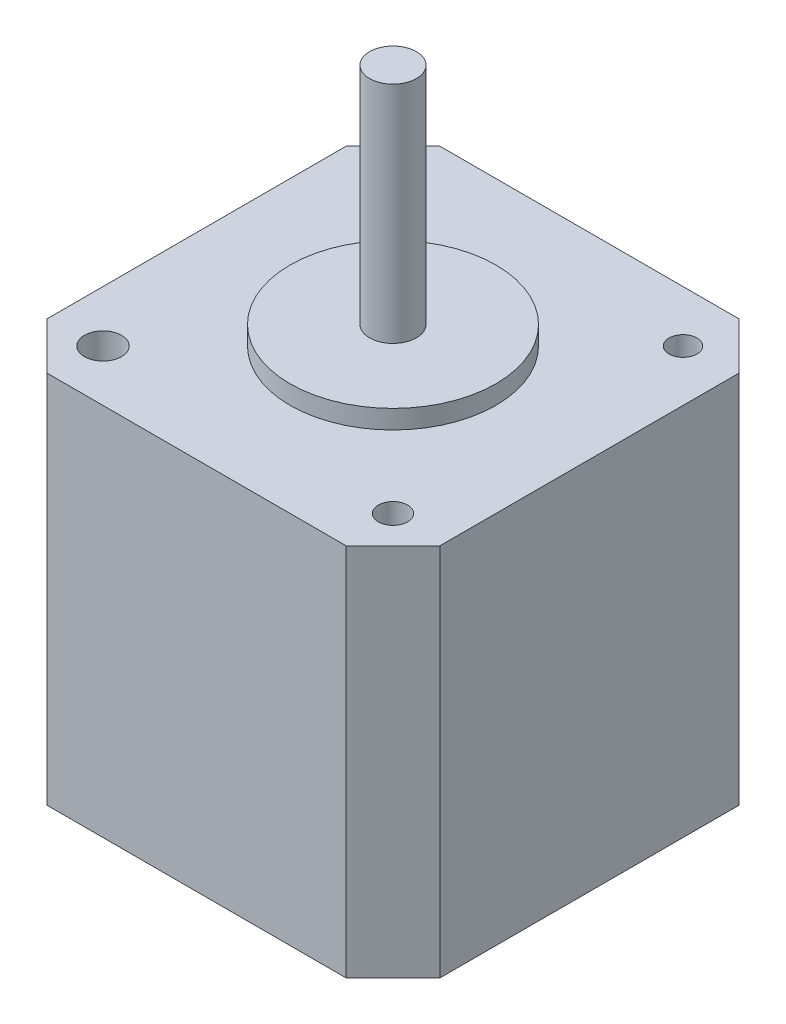
ISO-10303-21;
HEADER;
FILE_DESCRIPTION(('STEP AP214'),'2;1');
FILE_NAME('part.step','',(''),(''),'','','');
FILE_SCHEMA(('AUTOMOTIVE_DESIGN { 1 0 10303 214 1 1 1 1 }'));
ENDSEC;
DATA;
#1=APPLICATION_CONTEXT('core data for automotive mechanical design processes');
#2=APPLICATION_PROTOCOL_DEFINITION('international standard','automotive_design',2000,#1);
#3=PRODUCT_CONTEXT('',#1,'mechanical');
#4=PRODUCT('Part','Part','',(#3));
#5=PRODUCT_RELATED_PRODUCT_CATEGORY('part','',(#4));
#6=PRODUCT_DEFINITION_FORMATION('','',#4);
#7=PRODUCT_DEFINITION_CONTEXT('part definition',#1,'design');
#8=PRODUCT_DEFINITION('design','',#6,#7);
#9=PRODUCT_DEFINITION_SHAPE('','',#8);
#10=(LENGTH_UNIT() NAMED_UNIT(*) SI_UNIT(.MILLI.,.METRE.));
#11=(NAMED_UNIT(*) PLANE_ANGLE_UNIT() SI_UNIT($,.RADIAN.));
#12=(NAMED_UNIT(*) SI_UNIT($,.STERADIAN.) SOLID_ANGLE_UNIT());
#13=UNCERTAINTY_MEASURE_WITH_UNIT(LENGTH_MEASURE(1.E-05),#10,'distance_accuracy_value','');
#14=(GEOMETRIC_REPRESENTATION_CONTEXT(3) GLOBAL_UNCERTAINTY_ASSIGNED_CONTEXT((#13)) GLOBAL_UNIT_ASSIGNED_CONTEXT((#10,
#11,#12)) REPRESENTATION_CONTEXT('',''));
#15=CARTESIAN_POINT('',(0.,0.,0.));
#16=DIRECTION('',(0.,0.,1.));
#17=DIRECTION('',(1.,0.,0.));
#18=AXIS2_PLACEMENT_3D('',#15,#16,#17);
#19=CARTESIAN_POINT('',(-21.,40.,21.));
#20=DIRECTION('',(1.,0.,0.));
#21=DIRECTION('',(0.,0.,-1.));
#22=AXIS2_PLACEMENT_3D('',#19,#20,#21);
#23=PLANE('',#22);
#24=DIRECTION('',(0.,0.,1.));
#25=VECTOR('',#24,1.);
#26=CARTESIAN_POINT('',(-21.,0.,21.));
#27=LINE('',#26,#25);
#28=CARTESIAN_POINT('',(-21.,0.,-16.));
#29=VERTEX_POINT('',#28);
#30=CARTESIAN_POINT('',(-21.,0.,16.));
#31=VERTEX_POINT('',#30);
#32=EDGE_CURVE('E143',#29,#31,#27,.T.);
#33=ORIENTED_EDGE('',*,*,#32,.T.);
#34=DIRECTION('',(0.,1.,0.));
#35=VECTOR('',#34,1.);
#36=CARTESIAN_POINT('',(-21.,40.,16.));
#37=LINE('',#36,#35);
#38=CARTESIAN_POINT('',(-21.,40.,16.));
#39=VERTEX_POINT('',#38);
#40=EDGE_CURVE('E117',#31,#39,#37,.T.);
#41=ORIENTED_EDGE('',*,*,#40,.T.);
#42=DIRECTION('',(0.,0.,1.));
#43=VECTOR('',#42,1.);
#44=CARTESIAN_POINT('',(-21.,40.,21.));
#45=LINE('',#44,#43);
#46=CARTESIAN_POINT('',(-21.,40.,-16.));
#47=VERTEX_POINT('',#46);
#48=EDGE_CURVE('E156',#47,#39,#45,.T.);
#49=ORIENTED_EDGE('',*,*,#48,.F.);
#50=DIRECTION('',(0.,-1.,0.));
#51=VECTOR('',#50,1.);
#52=CARTESIAN_POINT('',(-21.,40.,-16.));
#53=LINE('',#52,#51);
#54=EDGE_CURVE('E123',#47,#29,#53,.T.);
#55=ORIENTED_EDGE('',*,*,#54,.T.);
#56=EDGE_LOOP('',(#33,#41,#49,#55));
#57=FACE_BOUND('',#56,.T.);
#58=ADVANCED_FACE('F41',(#57),#23,.F.);
#59=CARTESIAN_POINT('',(21.,40.,21.));
#60=DIRECTION('',(0.,0.,-1.));
#61=DIRECTION('',(-1.,0.,0.));
#62=AXIS2_PLACEMENT_3D('',#59,#60,#61);
#63=PLANE('',#62);
#64=DIRECTION('',(1.,0.,0.));
#65=VECTOR('',#64,1.);
#66=CARTESIAN_POINT('',(21.,40.,21.));
#67=LINE('',#66,#65);
#68=CARTESIAN_POINT('',(-16.,40.,21.));
#69=VERTEX_POINT('',#68);
#70=CARTESIAN_POINT('',(16.,40.,21.));
#71=VERTEX_POINT('',#70);
#72=EDGE_CURVE('E133',#69,#71,#67,.T.);
#73=ORIENTED_EDGE('',*,*,#72,.F.);
#74=DIRECTION('',(0.,-1.,0.));
#75=VECTOR('',#74,1.);
#76=CARTESIAN_POINT('',(-16.,40.,21.));
#77=LINE('',#76,#75);
#78=CARTESIAN_POINT('',(-16.,0.,21.));
#79=VERTEX_POINT('',#78);
#80=EDGE_CURVE('E116',#69,#79,#77,.T.);
#81=ORIENTED_EDGE('',*,*,#80,.T.);
#82=DIRECTION('',(1.,0.,0.));
#83=VECTOR('',#82,1.);
#84=CARTESIAN_POINT('',(21.,0.,21.));
#85=LINE('',#84,#83);
#86=CARTESIAN_POINT('',(16.,0.,21.));
#87=VERTEX_POINT('',#86);
#88=EDGE_CURVE('E130',#79,#87,#85,.T.);
#89=ORIENTED_EDGE('',*,*,#88,.T.);
#90=DIRECTION('',(0.,1.,0.));
#91=VECTOR('',#90,1.);
#92=CARTESIAN_POINT('',(16.,40.,21.));
#93=LINE('',#92,#91);
#94=EDGE_CURVE('E136',#87,#71,#93,.T.);
#95=ORIENTED_EDGE('',*,*,#94,.T.);
#96=EDGE_LOOP('',(#73,#81,#89,#95));
#97=FACE_BOUND('',#96,.T.);
#98=ADVANCED_FACE('F129',(#97),#63,.F.);
#99=CARTESIAN_POINT('',(21.,40.,21.));
#100=DIRECTION('',(-1.,0.,0.));
#101=DIRECTION('',(0.,0.,1.));
#102=AXIS2_PLACEMENT_3D('',#99,#100,#101);
#103=PLANE('',#102);
#104=DIRECTION('',(0.,0.,-1.));
#105=VECTOR('',#104,1.);
#106=CARTESIAN_POINT('',(21.,40.,21.));
#107=LINE('',#106,#105);
#108=CARTESIAN_POINT('',(21.,40.,16.));
#109=VERTEX_POINT('',#108);
#110=CARTESIAN_POINT('',(21.,40.,-16.));
#111=VERTEX_POINT('',#110);
#112=EDGE_CURVE('E208',#109,#111,#107,.T.);
#113=ORIENTED_EDGE('',*,*,#112,.F.);
#114=DIRECTION('',(0.,-1.,0.));
#115=VECTOR('',#114,1.);
#116=CARTESIAN_POINT('',(21.,40.,16.));
#117=LINE('',#116,#115);
#118=CARTESIAN_POINT('',(21.,0.,16.));
#119=VERTEX_POINT('',#118);
#120=EDGE_CURVE('E46',#109,#119,#117,.T.);
#121=ORIENTED_EDGE('',*,*,#120,.T.);
#122=DIRECTION('',(0.,0.,-1.));
#123=VECTOR('',#122,1.);
#124=CARTESIAN_POINT('',(21.,0.,21.));
#125=LINE('',#124,#123);
#126=CARTESIAN_POINT('',(21.,0.,-16.));
#127=VERTEX_POINT('',#126);
#128=EDGE_CURVE('E142',#119,#127,#125,.T.);
#129=ORIENTED_EDGE('',*,*,#128,.T.);
#130=DIRECTION('',(0.,1.,0.));
#131=VECTOR('',#130,1.);
#132=CARTESIAN_POINT('',(21.,40.,-16.));
#133=LINE('',#132,#131);
#134=EDGE_CURVE('E187',#127,#111,#133,.T.);
#135=ORIENTED_EDGE('',*,*,#134,.T.);
#136=EDGE_LOOP('',(#113,#121,#129,#135));
#137=FACE_BOUND('',#136,.T.);
#138=ADVANCED_FACE('F222',(#137),#103,.F.);
#139=CARTESIAN_POINT('',(21.,40.,-21.));
#140=DIRECTION('',(0.,0.,1.));
#141=DIRECTION('',(1.,0.,0.));
#142=AXIS2_PLACEMENT_3D('',#139,#140,#141);
#143=PLANE('',#142);
#144=DIRECTION('',(-1.,0.,0.));
#145=VECTOR('',#144,1.);
#146=CARTESIAN_POINT('',(21.,0.,-21.));
#147=LINE('',#146,#145);
#148=CARTESIAN_POINT('',(16.,0.,-21.));
#149=VERTEX_POINT('',#148);
#150=CARTESIAN_POINT('',(-16.,0.,-21.));
#151=VERTEX_POINT('',#150);
#152=EDGE_CURVE('E148',#149,#151,#147,.T.);
#153=ORIENTED_EDGE('',*,*,#152,.T.);
#154=DIRECTION('',(0.,1.,0.));
#155=VECTOR('',#154,1.);
#156=CARTESIAN_POINT('',(-16.,40.,-21.));
#157=LINE('',#156,#155);
#158=CARTESIAN_POINT('',(-16.,40.,-21.));
#159=VERTEX_POINT('',#158);
#160=EDGE_CURVE('E60',#151,#159,#157,.T.);
#161=ORIENTED_EDGE('',*,*,#160,.T.);
#162=DIRECTION('',(-1.,0.,0.));
#163=VECTOR('',#162,1.);
#164=CARTESIAN_POINT('',(21.,40.,-21.));
#165=LINE('',#164,#163);
#166=CARTESIAN_POINT('',(16.,40.,-21.));
#167=VERTEX_POINT('',#166);
#168=EDGE_CURVE('E158',#167,#159,#165,.T.);
#169=ORIENTED_EDGE('',*,*,#168,.F.);
#170=DIRECTION('',(0.,-1.,0.));
#171=VECTOR('',#170,1.);
#172=CARTESIAN_POINT('',(16.,40.,-21.));
#173=LINE('',#172,#171);
#174=EDGE_CURVE('E182',#167,#149,#173,.T.);
#175=ORIENTED_EDGE('',*,*,#174,.T.);
#176=EDGE_LOOP('',(#153,#161,#169,#175));
#177=FACE_BOUND('',#176,.T.);
#178=ADVANCED_FACE('F220',(#177),#143,.F.);
#179=CARTESIAN_POINT('',(0.,40.,0.));
#180=DIRECTION('',(0.,1.,0.));
#181=DIRECTION('',(0.,0.,1.));
#182=AXIS2_PLACEMENT_3D('',#179,#180,#181);
#183=PLANE('',#182);
#184=CARTESIAN_POINT('',(-15.5,40.,-15.5));
#185=DIRECTION('',(0.,1.,0.));
#186=DIRECTION('',(0.,0.,1.));
#187=AXIS2_PLACEMENT_3D('',#184,#185,#186);
#188=CIRCLE('',#187,1.58283387293328);
#189=CARTESIAN_POINT('',(-15.5,40.,-13.9171661270667));
#190=VERTEX_POINT('',#189);
#191=EDGE_CURVE('E417',#190,#190,#188,.T.);
#192=ORIENTED_EDGE('',*,*,#191,.F.);
#193=EDGE_LOOP('',(#192));
#194=FACE_BOUND('',#193,.T.);
#195=CARTESIAN_POINT('',(-15.5,40.,15.5));
#196=DIRECTION('',(0.,1.,0.));
#197=DIRECTION('',(0.,0.,1.));
#198=AXIS2_PLACEMENT_3D('',#195,#196,#197);
#199=CIRCLE('',#198,1.9811298432568);
#200=CARTESIAN_POINT('',(-15.5,40.,17.4811298432568));
#201=VERTEX_POINT('',#200);
#202=EDGE_CURVE('E437',#201,#201,#199,.T.);
#203=ORIENTED_EDGE('',*,*,#202,.F.);
#204=EDGE_LOOP('',(#203));
#205=FACE_BOUND('',#204,.T.);
#206=CARTESIAN_POINT('',(15.5,40.,15.5));
#207=DIRECTION('',(0.,1.,0.));
#208=DIRECTION('',(0.,0.,1.));
#209=AXIS2_PLACEMENT_3D('',#206,#207,#208);
#210=CIRCLE('',#209,1.56185503032757);
#211=CARTESIAN_POINT('',(15.5,40.,17.0618550303276));
#212=VERTEX_POINT('',#211);
#213=EDGE_CURVE('E429',#212,#212,#210,.T.);
#214=ORIENTED_EDGE('',*,*,#213,.F.);
#215=EDGE_LOOP('',(#214));
#216=FACE_BOUND('',#215,.T.);
#217=CARTESIAN_POINT('',(15.5,40.,-15.5));
#218=DIRECTION('',(0.,1.,0.));
#219=DIRECTION('',(0.,0.,1.));
#220=AXIS2_PLACEMENT_3D('',#217,#218,#219);
#221=CIRCLE('',#220,1.49004264650584);
#222=CARTESIAN_POINT('',(15.5,40.,-14.0099573534942));
#223=VERTEX_POINT('',#222);
#224=EDGE_CURVE('E428',#223,#223,#221,.T.);
#225=ORIENTED_EDGE('',*,*,#224,.F.);
#226=EDGE_LOOP('',(#225));
#227=FACE_BOUND('',#226,.T.);
#228=CARTESIAN_POINT('',(0.,40.,0.));
#229=DIRECTION('',(0.,1.,0.));
#230=DIRECTION('',(0.,0.,1.));
#231=AXIS2_PLACEMENT_3D('',#228,#229,#230);
#232=CIRCLE('',#231,11.);
#233=CARTESIAN_POINT('',(0.,40.,11.));
#234=VERTEX_POINT('',#233);
#235=EDGE_CURVE('E52',#234,#234,#232,.T.);
#236=ORIENTED_EDGE('',*,*,#235,.F.);
#237=EDGE_LOOP('',(#236));
#238=FACE_BOUND('',#237,.T.);
#239=ORIENTED_EDGE('',*,*,#48,.T.);
#240=DIRECTION('',(-0.707106781186547,0.,-0.707106781186549));
#241=VECTOR('',#240,1.);
#242=CARTESIAN_POINT('',(-18.5,40.,18.5));
#243=LINE('',#242,#241);
#244=EDGE_CURVE('E179',#39,#69,#243,.F.);
#245=ORIENTED_EDGE('',*,*,#244,.T.);
#246=ORIENTED_EDGE('',*,*,#72,.T.);
#247=DIRECTION('',(-0.707106781186549,0.,0.707106781186547));
#248=VECTOR('',#247,1.);
#249=CARTESIAN_POINT('',(18.5,40.,18.5));
#250=LINE('',#249,#248);
#251=EDGE_CURVE('E173',#71,#109,#250,.F.);
#252=ORIENTED_EDGE('',*,*,#251,.T.);
#253=ORIENTED_EDGE('',*,*,#112,.T.);
#254=DIRECTION('',(0.707106781186547,0.,0.707106781186549));
#255=VECTOR('',#254,1.);
#256=CARTESIAN_POINT('',(18.5,40.,-18.5));
#257=LINE('',#256,#255);
#258=EDGE_CURVE('E67',#111,#167,#257,.F.);
#259=ORIENTED_EDGE('',*,*,#258,.T.);
#260=ORIENTED_EDGE('',*,*,#168,.T.);
#261=DIRECTION('',(0.707106781186549,0.,-0.707106781186547));
#262=VECTOR('',#261,1.);
#263=CARTESIAN_POINT('',(-18.5,40.,-18.5));
#264=LINE('',#263,#262);
#265=EDGE_CURVE('E176',#159,#47,#264,.F.);
#266=ORIENTED_EDGE('',*,*,#265,.T.);
#267=EDGE_LOOP('',(#239,#245,#246,#252,#253,#259,#260,#266));
#268=FACE_BOUND('',#267,.T.);
#269=ADVANCED_FACE('F212',(#194,#205,#216,#227,#238,#268),#183,.T.);
#270=CARTESIAN_POINT('',(0.,0.,0.));
#271=DIRECTION('',(0.,1.,0.));
#272=DIRECTION('',(0.,0.,1.));
#273=AXIS2_PLACEMENT_3D('',#270,#271,#272);
#274=PLANE('',#273);
#275=ORIENTED_EDGE('',*,*,#88,.F.);
#276=DIRECTION('',(0.707106781186547,0.,0.707106781186549));
#277=VECTOR('',#276,1.);
#278=CARTESIAN_POINT('',(-16.,0.,21.));
#279=LINE('',#278,#277);
#280=EDGE_CURVE('E112',#79,#31,#279,.F.);
#281=ORIENTED_EDGE('',*,*,#280,.T.);
#282=ORIENTED_EDGE('',*,*,#32,.F.);
#283=DIRECTION('',(-0.707106781186549,0.,0.707106781186547));
#284=VECTOR('',#283,1.);
#285=CARTESIAN_POINT('',(-21.,0.,-16.));
#286=LINE('',#285,#284);
#287=EDGE_CURVE('E124',#29,#151,#286,.F.);
#288=ORIENTED_EDGE('',*,*,#287,.T.);
#289=ORIENTED_EDGE('',*,*,#152,.F.);
#290=DIRECTION('',(-0.707106781186547,0.,-0.707106781186549));
#291=VECTOR('',#290,1.);
#292=CARTESIAN_POINT('',(16.,0.,-21.));
#293=LINE('',#292,#291);
#294=EDGE_CURVE('E135',#149,#127,#293,.F.);
#295=ORIENTED_EDGE('',*,*,#294,.T.);
#296=ORIENTED_EDGE('',*,*,#128,.F.);
#297=DIRECTION('',(0.707106781186549,0.,-0.707106781186547));
#298=VECTOR('',#297,1.);
#299=CARTESIAN_POINT('',(21.,0.,16.));
#300=LINE('',#299,#298);
#301=EDGE_CURVE('E140',#119,#87,#300,.F.);
#302=ORIENTED_EDGE('',*,*,#301,.T.);
#303=EDGE_LOOP('',(#275,#281,#282,#288,#289,#295,#296,#302));
#304=FACE_BOUND('',#303,.T.);
#305=ADVANCED_FACE('F138',(#304),#274,.F.);
#306=CARTESIAN_POINT('',(-16.,40.,21.));
#307=DIRECTION('',(0.707106781186549,0.,-0.707106781186547));
#308=DIRECTION('',(0.,-1.,0.));
#309=AXIS2_PLACEMENT_3D('',#306,#307,#308);
#310=PLANE('',#309);
#311=ORIENTED_EDGE('',*,*,#244,.F.);
#312=ORIENTED_EDGE('',*,*,#40,.F.);
#313=ORIENTED_EDGE('',*,*,#280,.F.);
#314=ORIENTED_EDGE('',*,*,#80,.F.);
#315=EDGE_LOOP('',(#311,#312,#313,#314));
#316=FACE_BOUND('',#315,.T.);
#317=ADVANCED_FACE('F115',(#316),#310,.F.);
#318=CARTESIAN_POINT('',(-21.,40.,-16.));
#319=DIRECTION('',(0.707106781186547,0.,0.707106781186549));
#320=DIRECTION('',(0.,-1.,0.));
#321=AXIS2_PLACEMENT_3D('',#318,#319,#320);
#322=PLANE('',#321);
#323=ORIENTED_EDGE('',*,*,#265,.F.);
#324=ORIENTED_EDGE('',*,*,#160,.F.);
#325=ORIENTED_EDGE('',*,*,#287,.F.);
#326=ORIENTED_EDGE('',*,*,#54,.F.);
#327=EDGE_LOOP('',(#323,#324,#325,#326));
#328=FACE_BOUND('',#327,.T.);
#329=ADVANCED_FACE('F217',(#328),#322,.F.);
#330=CARTESIAN_POINT('',(21.,40.,16.));
#331=DIRECTION('',(-0.707106781186547,0.,-0.707106781186549));
#332=DIRECTION('',(0.,-1.,0.));
#333=AXIS2_PLACEMENT_3D('',#330,#331,#332);
#334=PLANE('',#333);
#335=ORIENTED_EDGE('',*,*,#251,.F.);
#336=ORIENTED_EDGE('',*,*,#94,.F.);
#337=ORIENTED_EDGE('',*,*,#301,.F.);
#338=ORIENTED_EDGE('',*,*,#120,.F.);
#339=EDGE_LOOP('',(#335,#336,#337,#338));
#340=FACE_BOUND('',#339,.T.);
#341=ADVANCED_FACE('F246',(#340),#334,.F.);
#342=CARTESIAN_POINT('',(16.,40.,-21.));
#343=DIRECTION('',(-0.707106781186549,0.,0.707106781186547));
#344=DIRECTION('',(0.,-1.,0.));
#345=AXIS2_PLACEMENT_3D('',#342,#343,#344);
#346=PLANE('',#345);
#347=ORIENTED_EDGE('',*,*,#258,.F.);
#348=ORIENTED_EDGE('',*,*,#134,.F.);
#349=ORIENTED_EDGE('',*,*,#294,.F.);
#350=ORIENTED_EDGE('',*,*,#174,.F.);
#351=EDGE_LOOP('',(#347,#348,#349,#350));
#352=FACE_BOUND('',#351,.T.);
#353=ADVANCED_FACE('F44',(#352),#346,.F.);
#354=CARTESIAN_POINT('',(0.,42.,0.));
#355=DIRECTION('',(0.,-1.,0.));
#356=DIRECTION('',(0.,0.,-1.));
#357=AXIS2_PLACEMENT_3D('',#354,#355,#356);
#358=CYLINDRICAL_SURFACE('',#357,11.);
#359=CARTESIAN_POINT('',(0.,42.,0.));
#360=DIRECTION('',(0.,1.,0.));
#361=DIRECTION('',(0.,0.,1.));
#362=AXIS2_PLACEMENT_3D('',#359,#360,#361);
#363=CIRCLE('',#362,11.);
#364=CARTESIAN_POINT('',(0.,42.,11.));
#365=VERTEX_POINT('',#364);
#366=EDGE_CURVE('E150',#365,#365,#363,.T.);
#367=ORIENTED_EDGE('',*,*,#366,.F.);
#368=EDGE_LOOP('',(#367));
#369=FACE_BOUND('',#368,.T.);
#370=ORIENTED_EDGE('',*,*,#235,.T.);
#371=EDGE_LOOP('',(#370));
#372=FACE_BOUND('',#371,.T.);
#373=ADVANCED_FACE('F254',(#369,#372),#358,.T.);
#374=CARTESIAN_POINT('',(0.,42.,0.));
#375=DIRECTION('',(0.,1.,0.));
#376=DIRECTION('',(0.,0.,1.));
#377=AXIS2_PLACEMENT_3D('',#374,#375,#376);
#378=PLANE('',#377);
#379=CARTESIAN_POINT('',(0.,42.,0.));
#380=DIRECTION('',(0.,1.,0.));
#381=DIRECTION('',(0.,0.,1.));
#382=AXIS2_PLACEMENT_3D('',#379,#380,#381);
#383=CIRCLE('',#382,2.5);
#384=CARTESIAN_POINT('',(0.,42.,2.5));
#385=VERTEX_POINT('',#384);
#386=EDGE_CURVE('E11',#385,#385,#383,.T.);
#387=ORIENTED_EDGE('',*,*,#386,.F.);
#388=EDGE_LOOP('',(#387));
#389=FACE_BOUND('',#388,.T.);
#390=ORIENTED_EDGE('',*,*,#366,.T.);
#391=EDGE_LOOP('',(#390));
#392=FACE_BOUND('',#391,.T.);
#393=ADVANCED_FACE('F259',(#389,#392),#378,.T.);
#394=CARTESIAN_POINT('',(15.5,32.,-15.5));
#395=DIRECTION('',(0.,1.,0.));
#396=DIRECTION('',(0.,0.,1.));
#397=AXIS2_PLACEMENT_3D('',#394,#395,#396);
#398=CYLINDRICAL_SURFACE('',#397,1.49004264650584);
#399=CARTESIAN_POINT('',(15.5,32.,-15.5));
#400=DIRECTION('',(0.,1.,0.));
#401=DIRECTION('',(0.,0.,1.));
#402=AXIS2_PLACEMENT_3D('',#399,#400,#401);
#403=CIRCLE('',#402,1.49004264650584);
#404=CARTESIAN_POINT('',(15.5,32.,-14.0099573534942));
#405=VERTEX_POINT('',#404);
#406=EDGE_CURVE('E444',#405,#405,#403,.T.);
#407=ORIENTED_EDGE('',*,*,#406,.F.);
#408=EDGE_LOOP('',(#407));
#409=FACE_BOUND('',#408,.T.);
#410=ORIENTED_EDGE('',*,*,#224,.T.);
#411=EDGE_LOOP('',(#410));
#412=FACE_BOUND('',#411,.T.);
#413=ADVANCED_FACE('F265',(#409,#412),#398,.F.);
#414=CARTESIAN_POINT('',(15.5,32.,-15.5));
#415=DIRECTION('',(0.,1.,0.));
#416=DIRECTION('',(0.,0.,1.));
#417=AXIS2_PLACEMENT_3D('',#414,#415,#416);
#418=PLANE('',#417);
#419=ORIENTED_EDGE('',*,*,#406,.T.);
#420=EDGE_LOOP('',(#419));
#421=FACE_BOUND('',#420,.T.);
#422=ADVANCED_FACE('F315',(#421),#418,.T.);
#423=CARTESIAN_POINT('',(15.5,32.,15.5));
#424=DIRECTION('',(0.,1.,0.));
#425=DIRECTION('',(0.,0.,1.));
#426=AXIS2_PLACEMENT_3D('',#423,#424,#425);
#427=CYLINDRICAL_SURFACE('',#426,1.56185503032757);
#428=CARTESIAN_POINT('',(15.5,32.,15.5));
#429=DIRECTION('',(0.,1.,0.));
#430=DIRECTION('',(0.,0.,1.));
#431=AXIS2_PLACEMENT_3D('',#428,#429,#430);
#432=CIRCLE('',#431,1.56185503032757);
#433=CARTESIAN_POINT('',(15.5,32.,17.0618550303276));
#434=VERTEX_POINT('',#433);
#435=EDGE_CURVE('E424',#434,#434,#432,.T.);
#436=ORIENTED_EDGE('',*,*,#435,.F.);
#437=EDGE_LOOP('',(#436));
#438=FACE_BOUND('',#437,.T.);
#439=ORIENTED_EDGE('',*,*,#213,.T.);
#440=EDGE_LOOP('',(#439));
#441=FACE_BOUND('',#440,.T.);
#442=ADVANCED_FACE('F324',(#438,#441),#427,.F.);
#443=CARTESIAN_POINT('',(15.5,32.,15.5));
#444=DIRECTION('',(0.,1.,0.));
#445=DIRECTION('',(0.,0.,1.));
#446=AXIS2_PLACEMENT_3D('',#443,#444,#445);
#447=PLANE('',#446);
#448=ORIENTED_EDGE('',*,*,#435,.T.);
#449=EDGE_LOOP('',(#448));
#450=FACE_BOUND('',#449,.T.);
#451=ADVANCED_FACE('F334',(#450),#447,.T.);
#452=CARTESIAN_POINT('',(-15.5,32.,15.5));
#453=DIRECTION('',(0.,1.,0.));
#454=DIRECTION('',(0.,0.,1.));
#455=AXIS2_PLACEMENT_3D('',#452,#453,#454);
#456=CYLINDRICAL_SURFACE('',#455,1.9811298432568);
#457=CARTESIAN_POINT('',(-15.5,32.,15.5));
#458=DIRECTION('',(0.,1.,0.));
#459=DIRECTION('',(0.,0.,1.));
#460=AXIS2_PLACEMENT_3D('',#457,#458,#459);
#461=CIRCLE('',#460,1.9811298432568);
#462=CARTESIAN_POINT('',(-15.5,32.,17.4811298432568));
#463=VERTEX_POINT('',#462);
#464=EDGE_CURVE('E433',#463,#463,#461,.T.);
#465=ORIENTED_EDGE('',*,*,#464,.F.);
#466=EDGE_LOOP('',(#465));
#467=FACE_BOUND('',#466,.T.);
#468=ORIENTED_EDGE('',*,*,#202,.T.);
#469=EDGE_LOOP('',(#468));
#470=FACE_BOUND('',#469,.T.);
#471=ADVANCED_FACE('F344',(#467,#470),#456,.F.);
#472=CARTESIAN_POINT('',(-15.5,32.,15.5));
#473=DIRECTION('',(0.,1.,0.));
#474=DIRECTION('',(0.,0.,1.));
#475=AXIS2_PLACEMENT_3D('',#472,#473,#474);
#476=PLANE('',#475);
#477=ORIENTED_EDGE('',*,*,#464,.T.);
#478=EDGE_LOOP('',(#477));
#479=FACE_BOUND('',#478,.T.);
#480=ADVANCED_FACE('F354',(#479),#476,.T.);
#481=CARTESIAN_POINT('',(-15.5,32.,-15.5));
#482=DIRECTION('',(0.,1.,0.));
#483=DIRECTION('',(0.,0.,1.));
#484=AXIS2_PLACEMENT_3D('',#481,#482,#483);
#485=CYLINDRICAL_SURFACE('',#484,1.58283387293328);
#486=CARTESIAN_POINT('',(-15.5,32.,-15.5));
#487=DIRECTION('',(0.,1.,0.));
#488=DIRECTION('',(0.,0.,1.));
#489=AXIS2_PLACEMENT_3D('',#486,#487,#488);
#490=CIRCLE('',#489,1.58283387293328);
#491=CARTESIAN_POINT('',(-15.5,32.,-13.9171661270667));
#492=VERTEX_POINT('',#491);
#493=EDGE_CURVE('E421',#492,#492,#490,.T.);
#494=ORIENTED_EDGE('',*,*,#493,.F.);
#495=EDGE_LOOP('',(#494));
#496=FACE_BOUND('',#495,.T.);
#497=ORIENTED_EDGE('',*,*,#191,.T.);
#498=EDGE_LOOP('',(#497));
#499=FACE_BOUND('',#498,.T.);
#500=ADVANCED_FACE('F364',(#496,#499),#485,.F.);
#501=CARTESIAN_POINT('',(-15.5,32.,-15.5));
#502=DIRECTION('',(0.,1.,0.));
#503=DIRECTION('',(0.,0.,1.));
#504=AXIS2_PLACEMENT_3D('',#501,#502,#503);
#505=PLANE('',#504);
#506=ORIENTED_EDGE('',*,*,#493,.T.);
#507=EDGE_LOOP('',(#506));
#508=FACE_BOUND('',#507,.T.);
#509=ADVANCED_FACE('F374',(#508),#505,.T.);
#510=CARTESIAN_POINT('',(0.,66.,0.));
#511=DIRECTION('',(0.,-1.,0.));
#512=DIRECTION('',(0.,0.,-1.));
#513=AXIS2_PLACEMENT_3D('',#510,#511,#512);
#514=CYLINDRICAL_SURFACE('',#513,2.5);
#515=CARTESIAN_POINT('',(0.,66.,0.));
#516=DIRECTION('',(0.,1.,0.));
#517=DIRECTION('',(0.,0.,1.));
#518=AXIS2_PLACEMENT_3D('',#515,#516,#517);
#519=CIRCLE('',#518,2.5);
#520=CARTESIAN_POINT('',(0.,66.,2.5));
#521=VERTEX_POINT('',#520);
#522=EDGE_CURVE('E415',#521,#521,#519,.T.);
#523=ORIENTED_EDGE('',*,*,#522,.F.);
#524=EDGE_LOOP('',(#523));
#525=FACE_BOUND('',#524,.T.);
#526=ORIENTED_EDGE('',*,*,#386,.T.);
#527=EDGE_LOOP('',(#526));
#528=FACE_BOUND('',#527,.T.);
#529=ADVANCED_FACE('F384',(#525,#528),#514,.T.);
#530=CARTESIAN_POINT('',(0.,66.,0.));
#531=DIRECTION('',(0.,1.,0.));
#532=DIRECTION('',(0.,0.,1.));
#533=AXIS2_PLACEMENT_3D('',#530,#531,#532);
#534=PLANE('',#533);
#535=ORIENTED_EDGE('',*,*,#522,.T.);
#536=EDGE_LOOP('',(#535));
#537=FACE_BOUND('',#536,.T.);
#538=ADVANCED_FACE('F399',(#537),#534,.T.);
#539=CLOSED_SHELL('',(#58,#98,#138,#178,#269,#305,#317,#329,#341,#353,#373,#393,#413,#422,#442,
#451,#471,#480,#500,#509,#529,#538));
#540=MANIFOLD_SOLID_BREP('B2',#539);
#541=ADVANCED_BREP_SHAPE_REPRESENTATION('',(#18,#540),#14);
#542=SHAPE_DEFINITION_REPRESENTATION(#9,#541);
ENDSEC;
END-ISO-10303-21;
